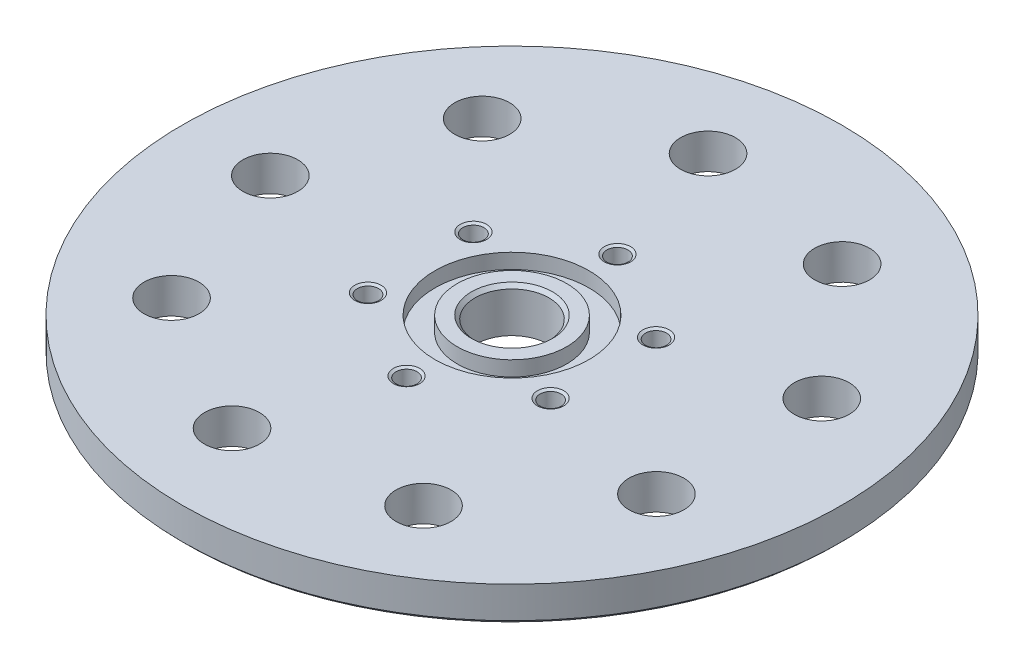
ISO-10303-21;
HEADER;
FILE_DESCRIPTION(('STEP AP214'),'2;1');
FILE_NAME('part.step','',(''),(''),'','','');
FILE_SCHEMA(('AUTOMOTIVE_DESIGN { 1 0 10303 214 1 1 1 1 }'));
ENDSEC;
DATA;
#1=APPLICATION_CONTEXT('core data for automotive mechanical design processes');
#2=APPLICATION_PROTOCOL_DEFINITION('international standard','automotive_design',2000,#1);
#3=PRODUCT_CONTEXT('',#1,'mechanical');
#4=PRODUCT('Part','Part','',(#3));
#5=PRODUCT_RELATED_PRODUCT_CATEGORY('part','',(#4));
#6=PRODUCT_DEFINITION_FORMATION('','',#4);
#7=PRODUCT_DEFINITION_CONTEXT('part definition',#1,'design');
#8=PRODUCT_DEFINITION('design','',#6,#7);
#9=PRODUCT_DEFINITION_SHAPE('','',#8);
#10=(LENGTH_UNIT() NAMED_UNIT(*) SI_UNIT(.MILLI.,.METRE.));
#11=(NAMED_UNIT(*) PLANE_ANGLE_UNIT() SI_UNIT($,.RADIAN.));
#12=(NAMED_UNIT(*) SI_UNIT($,.STERADIAN.) SOLID_ANGLE_UNIT());
#13=UNCERTAINTY_MEASURE_WITH_UNIT(LENGTH_MEASURE(1.E-05),#10,'distance_accuracy_value','');
#14=(GEOMETRIC_REPRESENTATION_CONTEXT(3) GLOBAL_UNCERTAINTY_ASSIGNED_CONTEXT((#13)) GLOBAL_UNIT_ASSIGNED_CONTEXT((#10,
#11,#12)) REPRESENTATION_CONTEXT('',''));
#15=CARTESIAN_POINT('',(0.,0.,0.));
#16=DIRECTION('',(0.,0.,1.));
#17=DIRECTION('',(1.,0.,0.));
#18=AXIS2_PLACEMENT_3D('',#15,#16,#17);
#19=CARTESIAN_POINT('',(0.,5.08,0.));
#20=DIRECTION('',(0.,-1.,0.));
#21=DIRECTION('',(0.,0.,-1.));
#22=AXIS2_PLACEMENT_3D('',#19,#20,#21);
#23=PLANE('',#22);
#24=CARTESIAN_POINT('',(13.1982271536748,5.08,-7.62000000000016));
#25=DIRECTION('',(0.,1.,0.));
#26=DIRECTION('',(0.,0.,1.));
#27=AXIS2_PLACEMENT_3D('',#24,#25,#26);
#28=CIRCLE('',#27,1.905);
#29=CARTESIAN_POINT('',(13.1982271536748,5.08,-5.71500000000016));
#30=VERTEX_POINT('',#29);
#31=EDGE_CURVE('E282',#30,#30,#28,.T.);
#32=ORIENTED_EDGE('',*,*,#31,.F.);
#33=EDGE_LOOP('',(#32));
#34=FACE_BOUND('',#33,.T.);
#35=CARTESIAN_POINT('',(-13.1982271536749,5.08,-7.61999999999996));
#36=DIRECTION('',(0.,1.,0.));
#37=DIRECTION('',(0.,0.,1.));
#38=AXIS2_PLACEMENT_3D('',#35,#36,#37);
#39=CIRCLE('',#38,1.905);
#40=CARTESIAN_POINT('',(-13.1982271536749,5.08,-5.71499999999996));
#41=VERTEX_POINT('',#40);
#42=EDGE_CURVE('E309',#41,#41,#39,.T.);
#43=ORIENTED_EDGE('',*,*,#42,.F.);
#44=EDGE_LOOP('',(#43));
#45=FACE_BOUND('',#44,.T.);
#46=CARTESIAN_POINT('',(0.,5.08,-15.24));
#47=DIRECTION('',(0.,1.,0.));
#48=DIRECTION('',(0.,0.,1.));
#49=AXIS2_PLACEMENT_3D('',#46,#47,#48);
#50=CIRCLE('',#49,1.905);
#51=CARTESIAN_POINT('',(0.,5.08,-13.335));
#52=VERTEX_POINT('',#51);
#53=EDGE_CURVE('E322',#52,#52,#50,.T.);
#54=ORIENTED_EDGE('',*,*,#53,.F.);
#55=EDGE_LOOP('',(#54));
#56=FACE_BOUND('',#55,.T.);
#57=CARTESIAN_POINT('',(0.,5.08,0.));
#58=DIRECTION('',(0.,1.,0.));
#59=DIRECTION('',(0.,0.,1.));
#60=AXIS2_PLACEMENT_3D('',#57,#58,#59);
#61=CIRCLE('',#60,11.1379);
#62=CARTESIAN_POINT('',(0.,5.08,11.1379));
#63=VERTEX_POINT('',#62);
#64=EDGE_CURVE('E398',#63,#63,#61,.T.);
#65=ORIENTED_EDGE('',*,*,#64,.F.);
#66=EDGE_LOOP('',(#65));
#67=FACE_BOUND('',#66,.T.);
#68=CARTESIAN_POINT('',(17.4625,5.08,30.2459372271715));
#69=DIRECTION('',(0.,1.,0.));
#70=DIRECTION('',(0.,0.,1.));
#71=AXIS2_PLACEMENT_3D('',#68,#69,#70);
#72=CIRCLE('',#71,3.96875);
#73=CARTESIAN_POINT('',(17.4625,5.08,34.2146872271715));
#74=VERTEX_POINT('',#73);
#75=EDGE_CURVE('E389',#74,#74,#72,.T.);
#76=ORIENTED_EDGE('',*,*,#75,.F.);
#77=EDGE_LOOP('',(#76));
#78=FACE_BOUND('',#77,.T.);
#79=CARTESIAN_POINT('',(32.8187647809479,5.08,11.9450535056489));
#80=DIRECTION('',(0.,1.,0.));
#81=DIRECTION('',(0.64278760968654,0.,0.766044443118976));
#82=AXIS2_PLACEMENT_3D('',#79,#80,#81);
#83=CIRCLE('',#82,3.96875);
#84=CARTESIAN_POINT('',(35.3698281068913,5.08,14.9852923892773));
#85=VERTEX_POINT('',#84);
#86=EDGE_CURVE('E383',#85,#85,#83,.T.);
#87=ORIENTED_EDGE('',*,*,#86,.F.);
#88=EDGE_LOOP('',(#87));
#89=FACE_BOUND('',#88,.T.);
#90=CARTESIAN_POINT('',(32.8187647809478,5.08,-11.9450535056491));
#91=DIRECTION('',(0.,1.,0.));
#92=DIRECTION('',(0.984807753012208,0.,0.173648177666927));
#93=AXIS2_PLACEMENT_3D('',#90,#91,#92);
#94=CIRCLE('',#93,3.96875);
#95=CARTESIAN_POINT('',(36.727220550715,5.08,-11.2558873005335));
#96=VERTEX_POINT('',#95);
#97=EDGE_CURVE('E377',#96,#96,#94,.T.);
#98=ORIENTED_EDGE('',*,*,#97,.F.);
#99=EDGE_LOOP('',(#98));
#100=FACE_BOUND('',#99,.T.);
#101=CARTESIAN_POINT('',(17.4624999999999,5.08,-30.2459372271716));
#102=DIRECTION('',(0.,1.,0.));
#103=DIRECTION('',(0.866025403784437,0.,-0.500000000000005));
#104=AXIS2_PLACEMENT_3D('',#101,#102,#103);
#105=CIRCLE('',#104,3.96875);
#106=CARTESIAN_POINT('',(20.8995383212694,5.08,-32.2303122271716));
#107=VERTEX_POINT('',#106);
#108=EDGE_CURVE('E371',#107,#107,#105,.T.);
#109=ORIENTED_EDGE('',*,*,#108,.F.);
#110=EDGE_LOOP('',(#109));
#111=FACE_BOUND('',#110,.T.);
#112=CARTESIAN_POINT('',(-6.06466260501772,5.08,-34.3944107739513));
#113=DIRECTION('',(0.,1.,0.));
#114=DIRECTION('',(0.342020143325664,0.,-0.939692620785911));
#115=AXIS2_PLACEMENT_3D('',#112,#113,#114);
#116=CIRCLE('',#115,3.96875);
#117=CARTESIAN_POINT('',(-4.707270161194,5.08,-38.1238158626954));
#118=VERTEX_POINT('',#117);
#119=EDGE_CURVE('E365',#118,#118,#116,.T.);
#120=ORIENTED_EDGE('',*,*,#119,.F.);
#121=EDGE_LOOP('',(#120));
#122=FACE_BOUND('',#121,.T.);
#123=CARTESIAN_POINT('',(-26.7541021759305,5.08,-22.4493572683022));
#124=DIRECTION('',(0.,1.,0.));
#125=DIRECTION('',(-0.342020143325675,0.,-0.939692620785905));
#126=AXIS2_PLACEMENT_3D('',#123,#124,#125);
#127=CIRCLE('',#126,3.96875);
#128=CARTESIAN_POINT('',(-28.1114946197542,5.08,-26.1787623570462));
#129=VERTEX_POINT('',#128);
#130=EDGE_CURVE('E359',#129,#129,#127,.T.);
#131=ORIENTED_EDGE('',*,*,#130,.F.);
#132=EDGE_LOOP('',(#131));
#133=FACE_BOUND('',#132,.T.);
#134=CARTESIAN_POINT('',(-34.925,5.08,3.46676506945975E-13));
#135=DIRECTION('',(0.,1.,0.));
#136=DIRECTION('',(-0.866025403784443,0.,-0.499999999999991));
#137=AXIS2_PLACEMENT_3D('',#134,#135,#136);
#138=CIRCLE('',#137,3.96875);
#139=CARTESIAN_POINT('',(-38.3620383212695,5.08,-1.98437499999962));
#140=VERTEX_POINT('',#139);
#141=EDGE_CURVE('E353',#140,#140,#138,.T.);
#142=ORIENTED_EDGE('',*,*,#141,.F.);
#143=EDGE_LOOP('',(#142));
#144=FACE_BOUND('',#143,.T.);
#145=CARTESIAN_POINT('',(-26.7541021759301,5.08,22.4493572683027));
#146=DIRECTION('',(0.,1.,0.));
#147=DIRECTION('',(-0.984807753012206,0.,0.173648177666941));
#148=AXIS2_PLACEMENT_3D('',#145,#146,#147);
#149=CIRCLE('',#148,3.96875);
#150=CARTESIAN_POINT('',(-30.6625579456973,5.08,23.1385234734183));
#151=VERTEX_POINT('',#150);
#152=EDGE_CURVE('E347',#151,#151,#149,.T.);
#153=ORIENTED_EDGE('',*,*,#152,.F.);
#154=EDGE_LOOP('',(#153));
#155=FACE_BOUND('',#154,.T.);
#156=CARTESIAN_POINT('',(-6.06466260501714,5.08,34.3944107739514));
#157=DIRECTION('',(0.,1.,0.));
#158=DIRECTION('',(-0.642787609686531,0.,0.766044443118987));
#159=AXIS2_PLACEMENT_3D('',#156,#157,#158);
#160=CIRCLE('',#159,3.96875);
#161=CARTESIAN_POINT('',(-8.61572593096056,5.08,37.4346496575799));
#162=VERTEX_POINT('',#161);
#163=EDGE_CURVE('E341',#162,#162,#160,.T.);
#164=ORIENTED_EDGE('',*,*,#163,.F.);
#165=EDGE_LOOP('',(#164));
#166=FACE_BOUND('',#165,.T.);
#167=CARTESIAN_POINT('',(0.,5.08,0.));
#168=DIRECTION('',(0.,-1.,0.));
#169=DIRECTION('',(0.,0.,-1.));
#170=AXIS2_PLACEMENT_3D('',#167,#168,#169);
#171=CIRCLE('',#170,47.625);
#172=CARTESIAN_POINT('',(0.,5.08,-47.625));
#173=VERTEX_POINT('',#172);
#174=EDGE_CURVE('E333',#173,#173,#171,.T.);
#175=ORIENTED_EDGE('',*,*,#174,.F.);
#176=EDGE_LOOP('',(#175));
#177=FACE_BOUND('',#176,.T.);
#178=CARTESIAN_POINT('',(-13.1982271536748,5.08,7.62000000000007));
#179=DIRECTION('',(0.,1.,0.));
#180=DIRECTION('',(0.,0.,1.));
#181=AXIS2_PLACEMENT_3D('',#178,#179,#180);
#182=CIRCLE('',#181,1.905);
#183=CARTESIAN_POINT('',(-13.1982271536748,5.08,9.52500000000007));
#184=VERTEX_POINT('',#183);
#185=EDGE_CURVE('E300',#184,#184,#182,.T.);
#186=ORIENTED_EDGE('',*,*,#185,.F.);
#187=EDGE_LOOP('',(#186));
#188=FACE_BOUND('',#187,.T.);
#189=CARTESIAN_POINT('',(0.,5.08,15.24));
#190=DIRECTION('',(0.,1.,0.));
#191=DIRECTION('',(0.,0.,1.));
#192=AXIS2_PLACEMENT_3D('',#189,#190,#191);
#193=CIRCLE('',#192,1.905);
#194=CARTESIAN_POINT('',(0.,5.08,17.145));
#195=VERTEX_POINT('',#194);
#196=EDGE_CURVE('E291',#195,#195,#193,.T.);
#197=ORIENTED_EDGE('',*,*,#196,.F.);
#198=EDGE_LOOP('',(#197));
#199=FACE_BOUND('',#198,.T.);
#200=CARTESIAN_POINT('',(13.1982271536749,5.08,7.61999999999987));
#201=DIRECTION('',(0.,1.,0.));
#202=DIRECTION('',(0.,0.,1.));
#203=AXIS2_PLACEMENT_3D('',#200,#201,#202);
#204=CIRCLE('',#203,1.905);
#205=CARTESIAN_POINT('',(13.1982271536749,5.08,9.52499999999987));
#206=VERTEX_POINT('',#205);
#207=EDGE_CURVE('E275',#206,#206,#204,.T.);
#208=ORIENTED_EDGE('',*,*,#207,.F.);
#209=EDGE_LOOP('',(#208));
#210=FACE_BOUND('',#209,.T.);
#211=ADVANCED_FACE('F238',(#34,#45,#56,#67,#78,#89,#100,#111,#122,#133,#144,#155,#166,#177,#188,
#199,#210),#23,.F.);
#212=CARTESIAN_POINT('',(0.,-1.27,0.));
#213=DIRECTION('',(0.,-1.,0.));
#214=DIRECTION('',(0.,0.,-1.));
#215=AXIS2_PLACEMENT_3D('',#212,#213,#214);
#216=PLANE('',#215);
#217=CARTESIAN_POINT('',(0.,-1.27,0.));
#218=DIRECTION('',(0.,-1.,0.));
#219=DIRECTION('',(0.,0.,-1.));
#220=AXIS2_PLACEMENT_3D('',#217,#218,#219);
#221=CIRCLE('',#220,5.3467);
#222=CARTESIAN_POINT('',(0.,-1.27,-5.3467));
#223=VERTEX_POINT('',#222);
#224=EDGE_CURVE('E334',#223,#223,#221,.T.);
#225=ORIENTED_EDGE('',*,*,#224,.F.);
#226=EDGE_LOOP('',(#225));
#227=FACE_BOUND('',#226,.T.);
#228=CARTESIAN_POINT('',(0.,-1.27,0.));
#229=DIRECTION('',(0.,-1.,0.));
#230=DIRECTION('',(0.,0.,-1.));
#231=AXIS2_PLACEMENT_3D('',#228,#229,#230);
#232=CIRCLE('',#231,10.9855);
#233=CARTESIAN_POINT('',(0.,-1.27,-10.9855));
#234=VERTEX_POINT('',#233);
#235=EDGE_CURVE('E318',#234,#234,#232,.T.);
#236=ORIENTED_EDGE('',*,*,#235,.T.);
#237=EDGE_LOOP('',(#236));
#238=FACE_BOUND('',#237,.T.);
#239=ADVANCED_FACE('F439',(#227,#238),#216,.T.);
#240=CARTESIAN_POINT('',(0.,0.,0.));
#241=DIRECTION('',(0.,-1.,0.));
#242=DIRECTION('',(0.,0.,-1.));
#243=AXIS2_PLACEMENT_3D('',#240,#241,#242);
#244=PLANE('',#243);
#245=CARTESIAN_POINT('',(0.,0.,0.));
#246=DIRECTION('',(0.,-1.,0.));
#247=DIRECTION('',(0.,0.,-1.));
#248=AXIS2_PLACEMENT_3D('',#245,#246,#247);
#249=CIRCLE('',#248,47.117);
#250=CARTESIAN_POINT('',(0.,0.,-47.117));
#251=VERTEX_POINT('',#250);
#252=EDGE_CURVE('E246',#251,#251,#249,.T.);
#253=ORIENTED_EDGE('',*,*,#252,.T.);
#254=EDGE_LOOP('',(#253));
#255=FACE_BOUND('',#254,.T.);
#256=CARTESIAN_POINT('',(0.,0.,0.));
#257=DIRECTION('',(0.,-1.,0.));
#258=DIRECTION('',(0.,0.,-1.));
#259=AXIS2_PLACEMENT_3D('',#256,#257,#258);
#260=CIRCLE('',#259,19.05);
#261=CARTESIAN_POINT('',(0.,0.,-19.05));
#262=VERTEX_POINT('',#261);
#263=EDGE_CURVE('E337',#262,#262,#260,.T.);
#264=ORIENTED_EDGE('',*,*,#263,.F.);
#265=EDGE_LOOP('',(#264));
#266=FACE_BOUND('',#265,.T.);
#267=CARTESIAN_POINT('',(-6.06466260501715,0.,34.3944107739514));
#268=DIRECTION('',(0.,-1.,0.));
#269=DIRECTION('',(0.,0.,-1.));
#270=AXIS2_PLACEMENT_3D('',#267,#268,#269);
#271=CIRCLE('',#270,3.96875);
#272=CARTESIAN_POINT('',(-6.06466260501714,0.,30.4256607739514));
#273=VERTEX_POINT('',#272);
#274=EDGE_CURVE('E340',#273,#273,#271,.F.);
#275=ORIENTED_EDGE('',*,*,#274,.T.);
#276=EDGE_LOOP('',(#275));
#277=FACE_BOUND('',#276,.T.);
#278=CARTESIAN_POINT('',(-26.7541021759301,0.,22.4493572683027));
#279=DIRECTION('',(0.,-1.,0.));
#280=DIRECTION('',(0.,0.,-1.));
#281=AXIS2_PLACEMENT_3D('',#278,#279,#280);
#282=CIRCLE('',#281,3.96875);
#283=CARTESIAN_POINT('',(-26.7541021759301,0.,18.4806072683027));
#284=VERTEX_POINT('',#283);
#285=EDGE_CURVE('E344',#284,#284,#282,.F.);
#286=ORIENTED_EDGE('',*,*,#285,.T.);
#287=EDGE_LOOP('',(#286));
#288=FACE_BOUND('',#287,.T.);
#289=CARTESIAN_POINT('',(-34.925,0.,3.46676506945975E-13));
#290=DIRECTION('',(0.,-1.,0.));
#291=DIRECTION('',(0.,0.,-1.));
#292=AXIS2_PLACEMENT_3D('',#289,#290,#291);
#293=CIRCLE('',#292,3.96875);
#294=CARTESIAN_POINT('',(-34.925,0.,-3.96874999999965));
#295=VERTEX_POINT('',#294);
#296=EDGE_CURVE('E350',#295,#295,#293,.F.);
#297=ORIENTED_EDGE('',*,*,#296,.T.);
#298=EDGE_LOOP('',(#297));
#299=FACE_BOUND('',#298,.T.);
#300=CARTESIAN_POINT('',(-26.7541021759305,0.,-22.4493572683022));
#301=DIRECTION('',(0.,-1.,0.));
#302=DIRECTION('',(0.,0.,-1.));
#303=AXIS2_PLACEMENT_3D('',#300,#301,#302);
#304=CIRCLE('',#303,3.96875);
#305=CARTESIAN_POINT('',(-26.7541021759305,0.,-26.4181072683022));
#306=VERTEX_POINT('',#305);
#307=EDGE_CURVE('E356',#306,#306,#304,.F.);
#308=ORIENTED_EDGE('',*,*,#307,.T.);
#309=EDGE_LOOP('',(#308));
#310=FACE_BOUND('',#309,.T.);
#311=CARTESIAN_POINT('',(-6.06466260501773,0.,-34.3944107739513));
#312=DIRECTION('',(0.,-1.,0.));
#313=DIRECTION('',(0.,0.,-1.));
#314=AXIS2_PLACEMENT_3D('',#311,#312,#313);
#315=CIRCLE('',#314,3.96875);
#316=CARTESIAN_POINT('',(-6.06466260501773,0.,-38.3631607739513));
#317=VERTEX_POINT('',#316);
#318=EDGE_CURVE('E362',#317,#317,#315,.F.);
#319=ORIENTED_EDGE('',*,*,#318,.T.);
#320=EDGE_LOOP('',(#319));
#321=FACE_BOUND('',#320,.T.);
#322=CARTESIAN_POINT('',(17.4624999999999,0.,-30.2459372271716));
#323=DIRECTION('',(0.,-1.,0.));
#324=DIRECTION('',(0.,0.,-1.));
#325=AXIS2_PLACEMENT_3D('',#322,#323,#324);
#326=CIRCLE('',#325,3.96875);
#327=CARTESIAN_POINT('',(17.4624999999999,0.,-34.2146872271716));
#328=VERTEX_POINT('',#327);
#329=EDGE_CURVE('E368',#328,#328,#326,.F.);
#330=ORIENTED_EDGE('',*,*,#329,.T.);
#331=EDGE_LOOP('',(#330));
#332=FACE_BOUND('',#331,.T.);
#333=CARTESIAN_POINT('',(32.8187647809478,0.,-11.9450535056491));
#334=DIRECTION('',(0.,-1.,0.));
#335=DIRECTION('',(0.,0.,-1.));
#336=AXIS2_PLACEMENT_3D('',#333,#334,#335);
#337=CIRCLE('',#336,3.96875);
#338=CARTESIAN_POINT('',(32.8187647809478,0.,-15.9138035056491));
#339=VERTEX_POINT('',#338);
#340=EDGE_CURVE('E374',#339,#339,#337,.F.);
#341=ORIENTED_EDGE('',*,*,#340,.T.);
#342=EDGE_LOOP('',(#341));
#343=FACE_BOUND('',#342,.T.);
#344=CARTESIAN_POINT('',(32.8187647809479,0.,11.9450535056489));
#345=DIRECTION('',(0.,-1.,0.));
#346=DIRECTION('',(0.,0.,-1.));
#347=AXIS2_PLACEMENT_3D('',#344,#345,#346);
#348=CIRCLE('',#347,3.96875);
#349=CARTESIAN_POINT('',(32.8187647809479,0.,7.97630350564891));
#350=VERTEX_POINT('',#349);
#351=EDGE_CURVE('E380',#350,#350,#348,.F.);
#352=ORIENTED_EDGE('',*,*,#351,.T.);
#353=EDGE_LOOP('',(#352));
#354=FACE_BOUND('',#353,.T.);
#355=CARTESIAN_POINT('',(17.4625,0.,30.2459372271715));
#356=DIRECTION('',(0.,-1.,0.));
#357=DIRECTION('',(0.,0.,-1.));
#358=AXIS2_PLACEMENT_3D('',#355,#356,#357);
#359=CIRCLE('',#358,3.96875);
#360=CARTESIAN_POINT('',(17.4625,0.,26.2771872271715));
#361=VERTEX_POINT('',#360);
#362=EDGE_CURVE('E386',#361,#361,#359,.F.);
#363=ORIENTED_EDGE('',*,*,#362,.T.);
#364=EDGE_LOOP('',(#363));
#365=FACE_BOUND('',#364,.T.);
#366=ADVANCED_FACE('F422',(#255,#266,#277,#288,#299,#310,#321,#332,#343,#354,#365),#244,.T.);
#367=CARTESIAN_POINT('',(0.,5.08,0.));
#368=DIRECTION('',(0.,-1.,0.));
#369=DIRECTION('',(0.,0.,-1.));
#370=AXIS2_PLACEMENT_3D('',#367,#368,#369);
#371=CIRCLE('',#370,5.85470000000003);
#372=CARTESIAN_POINT('',(0.,5.08,-5.85470000000003));
#373=VERTEX_POINT('',#372);
#374=EDGE_CURVE('E411',#373,#373,#371,.T.);
#375=ORIENTED_EDGE('',*,*,#374,.T.);
#376=EDGE_LOOP('',(#375));
#377=FACE_BOUND('',#376,.T.);
#378=CARTESIAN_POINT('',(0.,5.08,0.));
#379=DIRECTION('',(0.,1.,0.));
#380=DIRECTION('',(0.,0.,1.));
#381=AXIS2_PLACEMENT_3D('',#378,#379,#380);
#382=CIRCLE('',#381,7.9121);
#383=CARTESIAN_POINT('',(0.,5.08,7.9121));
#384=VERTEX_POINT('',#383);
#385=EDGE_CURVE('E392',#384,#384,#382,.T.);
#386=ORIENTED_EDGE('',*,*,#385,.T.);
#387=EDGE_LOOP('',(#386));
#388=FACE_BOUND('',#387,.T.);
#389=ADVANCED_FACE('F442',(#377,#388),#23,.F.);
#390=CARTESIAN_POINT('',(0.,-0.00100000000000013,0.));
#391=DIRECTION('',(0.,1.,0.));
#392=DIRECTION('',(0.,0.,1.));
#393=AXIS2_PLACEMENT_3D('',#390,#391,#392);
#394=CYLINDRICAL_SURFACE('',#393,5.3467);
#395=CARTESIAN_POINT('',(0.,4.57199999999998,0.));
#396=DIRECTION('',(0.,-1.,0.));
#397=DIRECTION('',(0.,0.,-1.));
#398=AXIS2_PLACEMENT_3D('',#395,#396,#397);
#399=CIRCLE('',#398,5.3467);
#400=CARTESIAN_POINT('',(0.,4.57199999999998,-5.3467));
#401=VERTEX_POINT('',#400);
#402=EDGE_CURVE('E404',#401,#401,#399,.F.);
#403=ORIENTED_EDGE('',*,*,#402,.T.);
#404=EDGE_LOOP('',(#403));
#405=FACE_BOUND('',#404,.T.);
#406=ORIENTED_EDGE('',*,*,#224,.T.);
#407=EDGE_LOOP('',(#406));
#408=FACE_BOUND('',#407,.T.);
#409=ADVANCED_FACE('F453',(#405,#408),#394,.F.);
#410=CARTESIAN_POINT('',(0.,2.921,0.));
#411=DIRECTION('',(0.,1.,0.));
#412=DIRECTION('',(0.,0.,1.));
#413=AXIS2_PLACEMENT_3D('',#410,#411,#412);
#414=CYLINDRICAL_SURFACE('',#413,11.1379);
#415=CARTESIAN_POINT('',(0.,2.921,0.));
#416=DIRECTION('',(0.,1.,0.));
#417=DIRECTION('',(0.,0.,1.));
#418=AXIS2_PLACEMENT_3D('',#415,#416,#417);
#419=CIRCLE('',#418,11.1379);
#420=CARTESIAN_POINT('',(0.,2.921,11.1379));
#421=VERTEX_POINT('',#420);
#422=EDGE_CURVE('E401',#421,#421,#419,.T.);
#423=ORIENTED_EDGE('',*,*,#422,.F.);
#424=EDGE_LOOP('',(#423));
#425=FACE_BOUND('',#424,.T.);
#426=ORIENTED_EDGE('',*,*,#64,.T.);
#427=EDGE_LOOP('',(#426));
#428=FACE_BOUND('',#427,.T.);
#429=ADVANCED_FACE('F459',(#425,#428),#414,.F.);
#430=CARTESIAN_POINT('',(0.,2.921,0.));
#431=DIRECTION('',(0.,1.,0.));
#432=DIRECTION('',(0.,0.,1.));
#433=AXIS2_PLACEMENT_3D('',#430,#431,#432);
#434=PLANE('',#433);
#435=CARTESIAN_POINT('',(0.,2.921,0.));
#436=DIRECTION('',(0.,1.,0.));
#437=DIRECTION('',(0.,0.,1.));
#438=AXIS2_PLACEMENT_3D('',#435,#436,#437);
#439=CIRCLE('',#438,7.9121);
#440=CARTESIAN_POINT('',(0.,2.921,7.9121));
#441=VERTEX_POINT('',#440);
#442=EDGE_CURVE('E395',#441,#441,#439,.T.);
#443=ORIENTED_EDGE('',*,*,#442,.F.);
#444=EDGE_LOOP('',(#443));
#445=FACE_BOUND('',#444,.T.);
#446=ORIENTED_EDGE('',*,*,#422,.T.);
#447=EDGE_LOOP('',(#446));
#448=FACE_BOUND('',#447,.T.);
#449=ADVANCED_FACE('F468',(#445,#448),#434,.T.);
#450=CARTESIAN_POINT('',(0.,2.921,0.));
#451=DIRECTION('',(0.,1.,0.));
#452=DIRECTION('',(0.,0.,1.));
#453=AXIS2_PLACEMENT_3D('',#450,#451,#452);
#454=CYLINDRICAL_SURFACE('',#453,7.9121);
#455=ORIENTED_EDGE('',*,*,#442,.T.);
#456=EDGE_LOOP('',(#455));
#457=FACE_BOUND('',#456,.T.);
#458=ORIENTED_EDGE('',*,*,#385,.F.);
#459=EDGE_LOOP('',(#458));
#460=FACE_BOUND('',#459,.T.);
#461=ADVANCED_FACE('F465',(#457,#460),#454,.T.);
#462=CARTESIAN_POINT('',(17.4625,-0.000999999999999265,30.2459372271715));
#463=DIRECTION('',(0.,1.,0.));
#464=DIRECTION('',(0.,0.,1.));
#465=AXIS2_PLACEMENT_3D('',#462,#463,#464);
#466=CYLINDRICAL_SURFACE('',#465,3.96875);
#467=ORIENTED_EDGE('',*,*,#362,.F.);
#468=EDGE_LOOP('',(#467));
#469=FACE_BOUND('',#468,.T.);
#470=ORIENTED_EDGE('',*,*,#75,.T.);
#471=EDGE_LOOP('',(#470));
#472=FACE_BOUND('',#471,.T.);
#473=ADVANCED_FACE('F467',(#469,#472),#466,.F.);
#474=CARTESIAN_POINT('',(32.8187647809479,-0.00100000000000057,11.9450535056489));
#475=DIRECTION('',(0.,1.,0.));
#476=DIRECTION('',(0.,0.,1.));
#477=AXIS2_PLACEMENT_3D('',#474,#475,#476);
#478=CYLINDRICAL_SURFACE('',#477,3.96875);
#479=ORIENTED_EDGE('',*,*,#351,.F.);
#480=EDGE_LOOP('',(#479));
#481=FACE_BOUND('',#480,.T.);
#482=ORIENTED_EDGE('',*,*,#86,.T.);
#483=EDGE_LOOP('',(#482));
#484=FACE_BOUND('',#483,.T.);
#485=ADVANCED_FACE('F475',(#481,#484),#478,.F.);
#486=CARTESIAN_POINT('',(32.8187647809478,-0.000999999999999265,-11.9450535056491));
#487=DIRECTION('',(0.,1.,0.));
#488=DIRECTION('',(0.,0.,1.));
#489=AXIS2_PLACEMENT_3D('',#486,#487,#488);
#490=CYLINDRICAL_SURFACE('',#489,3.96875);
#491=ORIENTED_EDGE('',*,*,#340,.F.);
#492=EDGE_LOOP('',(#491));
#493=FACE_BOUND('',#492,.T.);
#494=ORIENTED_EDGE('',*,*,#97,.T.);
#495=EDGE_LOOP('',(#494));
#496=FACE_BOUND('',#495,.T.);
#497=ADVANCED_FACE('F614',(#493,#496),#490,.F.);
#498=CARTESIAN_POINT('',(17.4624999999999,-0.00100000000000273,-30.2459372271716));
#499=DIRECTION('',(0.,1.,0.));
#500=DIRECTION('',(0.,0.,1.));
#501=AXIS2_PLACEMENT_3D('',#498,#499,#500);
#502=CYLINDRICAL_SURFACE('',#501,3.96875);
#503=ORIENTED_EDGE('',*,*,#329,.F.);
#504=EDGE_LOOP('',(#503));
#505=FACE_BOUND('',#504,.T.);
#506=ORIENTED_EDGE('',*,*,#108,.T.);
#507=EDGE_LOOP('',(#506));
#508=FACE_BOUND('',#507,.T.);
#509=ADVANCED_FACE('F610',(#505,#508),#502,.F.);
#510=CARTESIAN_POINT('',(-6.06466260501773,-0.000999999999999265,-34.3944107739513));
#511=DIRECTION('',(0.,1.,0.));
#512=DIRECTION('',(0.,0.,1.));
#513=AXIS2_PLACEMENT_3D('',#510,#511,#512);
#514=CYLINDRICAL_SURFACE('',#513,3.96875);
#515=ORIENTED_EDGE('',*,*,#318,.F.);
#516=EDGE_LOOP('',(#515));
#517=FACE_BOUND('',#516,.T.);
#518=ORIENTED_EDGE('',*,*,#119,.T.);
#519=EDGE_LOOP('',(#518));
#520=FACE_BOUND('',#519,.T.);
#521=ADVANCED_FACE('F606',(#517,#520),#514,.F.);
#522=CARTESIAN_POINT('',(-26.7541021759305,-0.00100000000000187,-22.4493572683022));
#523=DIRECTION('',(0.,1.,0.));
#524=DIRECTION('',(0.,0.,1.));
#525=AXIS2_PLACEMENT_3D('',#522,#523,#524);
#526=CYLINDRICAL_SURFACE('',#525,3.96875);
#527=ORIENTED_EDGE('',*,*,#307,.F.);
#528=EDGE_LOOP('',(#527));
#529=FACE_BOUND('',#528,.T.);
#530=ORIENTED_EDGE('',*,*,#130,.T.);
#531=EDGE_LOOP('',(#530));
#532=FACE_BOUND('',#531,.T.);
#533=ADVANCED_FACE('F602',(#529,#532),#526,.F.);
#534=CARTESIAN_POINT('',(-34.925,-0.00100000000000273,3.49278592159941E-13));
#535=DIRECTION('',(0.,1.,0.));
#536=DIRECTION('',(0.,0.,1.));
#537=AXIS2_PLACEMENT_3D('',#534,#535,#536);
#538=CYLINDRICAL_SURFACE('',#537,3.96875);
#539=ORIENTED_EDGE('',*,*,#296,.F.);
#540=EDGE_LOOP('',(#539));
#541=FACE_BOUND('',#540,.T.);
#542=ORIENTED_EDGE('',*,*,#141,.T.);
#543=EDGE_LOOP('',(#542));
#544=FACE_BOUND('',#543,.T.);
#545=ADVANCED_FACE('F598',(#541,#544),#538,.F.);
#546=CARTESIAN_POINT('',(-26.7541021759301,-0.0010000000000062,22.4493572683027));
#547=DIRECTION('',(0.,1.,0.));
#548=DIRECTION('',(0.,0.,1.));
#549=AXIS2_PLACEMENT_3D('',#546,#547,#548);
#550=CYLINDRICAL_SURFACE('',#549,3.96875);
#551=ORIENTED_EDGE('',*,*,#285,.F.);
#552=EDGE_LOOP('',(#551));
#553=FACE_BOUND('',#552,.T.);
#554=ORIENTED_EDGE('',*,*,#152,.T.);
#555=EDGE_LOOP('',(#554));
#556=FACE_BOUND('',#555,.T.);
#557=ADVANCED_FACE('F594',(#553,#556),#550,.F.);
#558=CARTESIAN_POINT('',(-6.06466260501714,-0.000999999999999265,34.3944107739514));
#559=DIRECTION('',(0.,1.,0.));
#560=DIRECTION('',(0.,0.,1.));
#561=AXIS2_PLACEMENT_3D('',#558,#559,#560);
#562=CYLINDRICAL_SURFACE('',#561,3.96875);
#563=ORIENTED_EDGE('',*,*,#274,.F.);
#564=EDGE_LOOP('',(#563));
#565=FACE_BOUND('',#564,.T.);
#566=ORIENTED_EDGE('',*,*,#163,.T.);
#567=EDGE_LOOP('',(#566));
#568=FACE_BOUND('',#567,.T.);
#569=ADVANCED_FACE('F590',(#565,#568),#562,.F.);
#570=CARTESIAN_POINT('',(0.,-1.27,0.));
#571=DIRECTION('',(0.,1.,0.));
#572=DIRECTION('',(0.,0.,1.));
#573=AXIS2_PLACEMENT_3D('',#570,#571,#572);
#574=CYLINDRICAL_SURFACE('',#573,19.05);
#575=CARTESIAN_POINT('',(0.,-1.52400000000001,0.));
#576=DIRECTION('',(0.,-1.,0.));
#577=DIRECTION('',(0.,0.,-1.));
#578=AXIS2_PLACEMENT_3D('',#575,#576,#577);
#579=CIRCLE('',#578,19.05);
#580=CARTESIAN_POINT('',(0.,-1.52400000000001,-19.05));
#581=VERTEX_POINT('',#580);
#582=EDGE_CURVE('E417',#581,#581,#579,.F.);
#583=ORIENTED_EDGE('',*,*,#582,.T.);
#584=EDGE_LOOP('',(#583));
#585=FACE_BOUND('',#584,.T.);
#586=ORIENTED_EDGE('',*,*,#263,.T.);
#587=EDGE_LOOP('',(#586));
#588=FACE_BOUND('',#587,.T.);
#589=ADVANCED_FACE('F585',(#585,#588),#574,.T.);
#590=CARTESIAN_POINT('',(0.,-1.27,0.));
#591=DIRECTION('',(0.,1.,0.));
#592=DIRECTION('',(0.,0.,1.));
#593=AXIS2_PLACEMENT_3D('',#590,#591,#592);
#594=CYLINDRICAL_SURFACE('',#593,47.625);
#595=CARTESIAN_POINT('',(0.,0.50799999999998,0.));
#596=DIRECTION('',(0.,-1.,0.));
#597=DIRECTION('',(0.,0.,-1.));
#598=AXIS2_PLACEMENT_3D('',#595,#596,#597);
#599=CIRCLE('',#598,47.625);
#600=CARTESIAN_POINT('',(0.,0.50799999999998,-47.625));
#601=VERTEX_POINT('',#600);
#602=EDGE_CURVE('E12',#601,#601,#599,.F.);
#603=ORIENTED_EDGE('',*,*,#602,.T.);
#604=EDGE_LOOP('',(#603));
#605=FACE_BOUND('',#604,.T.);
#606=ORIENTED_EDGE('',*,*,#174,.T.);
#607=EDGE_LOOP('',(#606));
#608=FACE_BOUND('',#607,.T.);
#609=ADVANCED_FACE('F583',(#605,#608),#594,.T.);
#610=CARTESIAN_POINT('',(0.,-0.253999999999999,-15.24));
#611=DIRECTION('',(0.,1.,0.));
#612=DIRECTION('',(0.,0.,1.));
#613=AXIS2_PLACEMENT_3D('',#610,#611,#612);
#614=CONICAL_SURFACE('',#613,1.524,1.02974425867665);
#615=CARTESIAN_POINT('',(0.,-1.169711583398,-15.24));
#616=VERTEX_POINT('',#615);
#617=VERTEX_LOOP('',#616);
#618=FACE_BOUND('',#617,.T.);
#619=CARTESIAN_POINT('',(0.,-0.253999999999999,-15.24));
#620=DIRECTION('',(0.,1.,0.));
#621=DIRECTION('',(0.,0.,1.));
#622=AXIS2_PLACEMENT_3D('',#619,#620,#621);
#623=CIRCLE('',#622,1.524);
#624=CARTESIAN_POINT('',(0.,-0.253999999999999,-13.716));
#625=VERTEX_POINT('',#624);
#626=EDGE_CURVE('E330',#625,#625,#623,.T.);
#627=ORIENTED_EDGE('',*,*,#626,.T.);
#628=EDGE_LOOP('',(#627));
#629=FACE_BOUND('',#628,.T.);
#630=ADVANCED_FACE('F579',(#618,#629),#614,.F.);
#631=CARTESIAN_POINT('',(0.,5.08,-15.24));
#632=DIRECTION('',(0.,1.,0.));
#633=DIRECTION('',(0.,0.,1.));
#634=AXIS2_PLACEMENT_3D('',#631,#632,#633);
#635=CYLINDRICAL_SURFACE('',#634,1.524);
#636=ORIENTED_EDGE('',*,*,#626,.F.);
#637=EDGE_LOOP('',(#636));
#638=FACE_BOUND('',#637,.T.);
#639=CARTESIAN_POINT('',(0.,4.86002954743875,-15.24));
#640=DIRECTION('',(0.,1.,0.));
#641=DIRECTION('',(0.,0.,1.));
#642=AXIS2_PLACEMENT_3D('',#639,#640,#641);
#643=CIRCLE('',#642,1.524);
#644=CARTESIAN_POINT('',(0.,4.86002954743875,-13.716));
#645=VERTEX_POINT('',#644);
#646=EDGE_CURVE('E327',#645,#645,#643,.T.);
#647=ORIENTED_EDGE('',*,*,#646,.T.);
#648=EDGE_LOOP('',(#647));
#649=FACE_BOUND('',#648,.T.);
#650=ADVANCED_FACE('F575',(#638,#649),#635,.F.);
#651=CARTESIAN_POINT('',(0.,5.08,-15.24));
#652=DIRECTION('',(0.,1.,0.));
#653=DIRECTION('',(0.,0.,1.));
#654=AXIS2_PLACEMENT_3D('',#651,#652,#653);
#655=CONICAL_SURFACE('',#654,1.905,1.0471975511966);
#656=ORIENTED_EDGE('',*,*,#646,.F.);
#657=EDGE_LOOP('',(#656));
#658=FACE_BOUND('',#657,.T.);
#659=ORIENTED_EDGE('',*,*,#53,.T.);
#660=EDGE_LOOP('',(#659));
#661=FACE_BOUND('',#660,.T.);
#662=ADVANCED_FACE('F571',(#658,#661),#655,.F.);
#663=CARTESIAN_POINT('',(0.,-2.032,0.));
#664=DIRECTION('',(0.,-1.,0.));
#665=DIRECTION('',(0.,0.,-1.));
#666=AXIS2_PLACEMENT_3D('',#663,#664,#665);
#667=PLANE('',#666);
#668=CARTESIAN_POINT('',(0.,-2.032,0.));
#669=DIRECTION('',(0.,-1.,0.));
#670=DIRECTION('',(0.,0.,-1.));
#671=AXIS2_PLACEMENT_3D('',#668,#669,#670);
#672=CIRCLE('',#671,18.542);
#673=CARTESIAN_POINT('',(0.,-2.032,-18.542));
#674=VERTEX_POINT('',#673);
#675=EDGE_CURVE('E414',#674,#674,#672,.T.);
#676=ORIENTED_EDGE('',*,*,#675,.T.);
#677=EDGE_LOOP('',(#676));
#678=FACE_BOUND('',#677,.T.);
#679=CARTESIAN_POINT('',(0.,-2.032,0.));
#680=DIRECTION('',(0.,-1.,0.));
#681=DIRECTION('',(0.,0.,-1.));
#682=AXIS2_PLACEMENT_3D('',#679,#680,#681);
#683=CIRCLE('',#682,10.9855);
#684=CARTESIAN_POINT('',(0.,-2.032,-10.9855));
#685=VERTEX_POINT('',#684);
#686=EDGE_CURVE('E319',#685,#685,#683,.T.);
#687=ORIENTED_EDGE('',*,*,#686,.F.);
#688=EDGE_LOOP('',(#687));
#689=FACE_BOUND('',#688,.T.);
#690=ADVANCED_FACE('F567',(#678,#689),#667,.T.);
#691=CARTESIAN_POINT('',(0.,-2.032,0.));
#692=DIRECTION('',(0.,1.,0.));
#693=DIRECTION('',(0.,0.,1.));
#694=AXIS2_PLACEMENT_3D('',#691,#692,#693);
#695=CYLINDRICAL_SURFACE('',#694,10.9855);
#696=ORIENTED_EDGE('',*,*,#686,.T.);
#697=EDGE_LOOP('',(#696));
#698=FACE_BOUND('',#697,.T.);
#699=ORIENTED_EDGE('',*,*,#235,.F.);
#700=EDGE_LOOP('',(#699));
#701=FACE_BOUND('',#700,.T.);
#702=ADVANCED_FACE('F564',(#698,#701),#695,.F.);
#703=CARTESIAN_POINT('',(0.,4.57199999999998,0.));
#704=DIRECTION('',(0.,1.,0.));
#705=DIRECTION('',(0.,0.,1.));
#706=AXIS2_PLACEMENT_3D('',#703,#704,#705);
#707=CONICAL_SURFACE('',#706,5.3467,0.785398163397457);
#708=ORIENTED_EDGE('',*,*,#374,.F.);
#709=EDGE_LOOP('',(#708));
#710=FACE_BOUND('',#709,.T.);
#711=ORIENTED_EDGE('',*,*,#402,.F.);
#712=EDGE_LOOP('',(#711));
#713=FACE_BOUND('',#712,.T.);
#714=ADVANCED_FACE('F435',(#710,#713),#707,.F.);
#715=CARTESIAN_POINT('',(0.,-2.032,0.));
#716=DIRECTION('',(0.,1.,0.));
#717=DIRECTION('',(0.,0.,1.));
#718=AXIS2_PLACEMENT_3D('',#715,#716,#717);
#719=CONICAL_SURFACE('',#718,18.542,0.785398163397452);
#720=ORIENTED_EDGE('',*,*,#582,.F.);
#721=EDGE_LOOP('',(#720));
#722=FACE_BOUND('',#721,.T.);
#723=ORIENTED_EDGE('',*,*,#675,.F.);
#724=EDGE_LOOP('',(#723));
#725=FACE_BOUND('',#724,.T.);
#726=ADVANCED_FACE('F427',(#722,#725),#719,.T.);
#727=CARTESIAN_POINT('',(0.,0.,0.));
#728=DIRECTION('',(0.,1.,0.));
#729=DIRECTION('',(0.,0.,1.));
#730=AXIS2_PLACEMENT_3D('',#727,#728,#729);
#731=CONICAL_SURFACE('',#730,47.117,0.785398163397442);
#732=ORIENTED_EDGE('',*,*,#602,.F.);
#733=EDGE_LOOP('',(#732));
#734=FACE_BOUND('',#733,.T.);
#735=ORIENTED_EDGE('',*,*,#252,.F.);
#736=EDGE_LOOP('',(#735));
#737=FACE_BOUND('',#736,.T.);
#738=ADVANCED_FACE('F240',(#734,#737),#731,.T.);
#739=CARTESIAN_POINT('',(-13.1982271536749,-0.253999999999999,-7.61999999999996));
#740=DIRECTION('',(0.,1.,0.));
#741=DIRECTION('',(0.,0.,1.));
#742=AXIS2_PLACEMENT_3D('',#739,#740,#741);
#743=CONICAL_SURFACE('',#742,1.524,1.02974425867665);
#744=CARTESIAN_POINT('',(-13.1982271536749,-1.169711583398,-7.61999999999996));
#745=VERTEX_POINT('',#744);
#746=VERTEX_LOOP('',#745);
#747=FACE_BOUND('',#746,.T.);
#748=CARTESIAN_POINT('',(-13.1982271536749,-0.253999999999999,-7.61999999999996));
#749=DIRECTION('',(0.,1.,0.));
#750=DIRECTION('',(0.,0.,1.));
#751=AXIS2_PLACEMENT_3D('',#748,#749,#750);
#752=CIRCLE('',#751,1.524);
#753=CARTESIAN_POINT('',(-13.1982271536749,-0.253999999999999,-6.09599999999996));
#754=VERTEX_POINT('',#753);
#755=EDGE_CURVE('E315',#754,#754,#752,.T.);
#756=ORIENTED_EDGE('',*,*,#755,.T.);
#757=EDGE_LOOP('',(#756));
#758=FACE_BOUND('',#757,.T.);
#759=ADVANCED_FACE('F426',(#747,#758),#743,.F.);
#760=CARTESIAN_POINT('',(-13.1982271536749,5.08,-7.61999999999996));
#761=DIRECTION('',(0.,1.,0.));
#762=DIRECTION('',(0.,0.,1.));
#763=AXIS2_PLACEMENT_3D('',#760,#761,#762);
#764=CYLINDRICAL_SURFACE('',#763,1.524);
#765=ORIENTED_EDGE('',*,*,#755,.F.);
#766=EDGE_LOOP('',(#765));
#767=FACE_BOUND('',#766,.T.);
#768=CARTESIAN_POINT('',(-13.1982271536749,4.86002954743875,-7.61999999999996));
#769=DIRECTION('',(0.,1.,0.));
#770=DIRECTION('',(0.,0.,1.));
#771=AXIS2_PLACEMENT_3D('',#768,#769,#770);
#772=CIRCLE('',#771,1.524);
#773=CARTESIAN_POINT('',(-13.1982271536749,4.86002954743875,-6.09599999999996));
#774=VERTEX_POINT('',#773);
#775=EDGE_CURVE('E312',#774,#774,#772,.T.);
#776=ORIENTED_EDGE('',*,*,#775,.T.);
#777=EDGE_LOOP('',(#776));
#778=FACE_BOUND('',#777,.T.);
#779=ADVANCED_FACE('F433',(#767,#778),#764,.F.);
#780=CARTESIAN_POINT('',(-13.1982271536749,5.08,-7.61999999999996));
#781=DIRECTION('',(0.,1.,0.));
#782=DIRECTION('',(0.,0.,1.));
#783=AXIS2_PLACEMENT_3D('',#780,#781,#782);
#784=CONICAL_SURFACE('',#783,1.905,1.0471975511966);
#785=ORIENTED_EDGE('',*,*,#775,.F.);
#786=EDGE_LOOP('',(#785));
#787=FACE_BOUND('',#786,.T.);
#788=ORIENTED_EDGE('',*,*,#42,.T.);
#789=EDGE_LOOP('',(#788));
#790=FACE_BOUND('',#789,.T.);
#791=ADVANCED_FACE('F556',(#787,#790),#784,.F.);
#792=CARTESIAN_POINT('',(-13.1982271536748,-0.254,7.62000000000007));
#793=DIRECTION('',(0.,1.,0.));
#794=DIRECTION('',(0.,0.,1.));
#795=AXIS2_PLACEMENT_3D('',#792,#793,#794);
#796=CONICAL_SURFACE('',#795,1.524,1.02974425867665);
#797=CARTESIAN_POINT('',(-13.1982271536748,-1.169711583398,7.62000000000007));
#798=VERTEX_POINT('',#797);
#799=VERTEX_LOOP('',#798);
#800=FACE_BOUND('',#799,.T.);
#801=CARTESIAN_POINT('',(-13.1982271536748,-0.254,7.62000000000007));
#802=DIRECTION('',(0.,1.,0.));
#803=DIRECTION('',(0.,0.,1.));
#804=AXIS2_PLACEMENT_3D('',#801,#802,#803);
#805=CIRCLE('',#804,1.524);
#806=CARTESIAN_POINT('',(-13.1982271536748,-0.254,9.14400000000007));
#807=VERTEX_POINT('',#806);
#808=EDGE_CURVE('E306',#807,#807,#805,.T.);
#809=ORIENTED_EDGE('',*,*,#808,.T.);
#810=EDGE_LOOP('',(#809));
#811=FACE_BOUND('',#810,.T.);
#812=ADVANCED_FACE('F552',(#800,#811),#796,.F.);
#813=CARTESIAN_POINT('',(-13.1982271536748,5.08,7.62000000000007));
#814=DIRECTION('',(0.,1.,0.));
#815=DIRECTION('',(0.,0.,1.));
#816=AXIS2_PLACEMENT_3D('',#813,#814,#815);
#817=CYLINDRICAL_SURFACE('',#816,1.524);
#818=ORIENTED_EDGE('',*,*,#808,.F.);
#819=EDGE_LOOP('',(#818));
#820=FACE_BOUND('',#819,.T.);
#821=CARTESIAN_POINT('',(-13.1982271536748,4.86002954743875,7.62000000000007));
#822=DIRECTION('',(0.,1.,0.));
#823=DIRECTION('',(0.,0.,1.));
#824=AXIS2_PLACEMENT_3D('',#821,#822,#823);
#825=CIRCLE('',#824,1.524);
#826=CARTESIAN_POINT('',(-13.1982271536748,4.86002954743875,9.14400000000007));
#827=VERTEX_POINT('',#826);
#828=EDGE_CURVE('E303',#827,#827,#825,.T.);
#829=ORIENTED_EDGE('',*,*,#828,.T.);
#830=EDGE_LOOP('',(#829));
#831=FACE_BOUND('',#830,.T.);
#832=ADVANCED_FACE('F548',(#820,#831),#817,.F.);
#833=CARTESIAN_POINT('',(-13.1982271536748,5.08,7.62000000000007));
#834=DIRECTION('',(0.,1.,0.));
#835=DIRECTION('',(0.,0.,1.));
#836=AXIS2_PLACEMENT_3D('',#833,#834,#835);
#837=CONICAL_SURFACE('',#836,1.905,1.0471975511966);
#838=ORIENTED_EDGE('',*,*,#828,.F.);
#839=EDGE_LOOP('',(#838));
#840=FACE_BOUND('',#839,.T.);
#841=ORIENTED_EDGE('',*,*,#185,.T.);
#842=EDGE_LOOP('',(#841));
#843=FACE_BOUND('',#842,.T.);
#844=ADVANCED_FACE('F544',(#840,#843),#837,.F.);
#845=CARTESIAN_POINT('',(0.,-0.253999999999997,15.24));
#846=DIRECTION('',(0.,1.,0.));
#847=DIRECTION('',(0.,0.,1.));
#848=AXIS2_PLACEMENT_3D('',#845,#846,#847);
#849=CONICAL_SURFACE('',#848,1.524,1.02974425867665);
#850=CARTESIAN_POINT('',(0.,-1.169711583398,15.24));
#851=VERTEX_POINT('',#850);
#852=VERTEX_LOOP('',#851);
#853=FACE_BOUND('',#852,.T.);
#854=CARTESIAN_POINT('',(0.,-0.253999999999997,15.24));
#855=DIRECTION('',(0.,1.,0.));
#856=DIRECTION('',(0.,0.,1.));
#857=AXIS2_PLACEMENT_3D('',#854,#855,#856);
#858=CIRCLE('',#857,1.524);
#859=CARTESIAN_POINT('',(0.,-0.253999999999997,16.764));
#860=VERTEX_POINT('',#859);
#861=EDGE_CURVE('E297',#860,#860,#858,.T.);
#862=ORIENTED_EDGE('',*,*,#861,.T.);
#863=EDGE_LOOP('',(#862));
#864=FACE_BOUND('',#863,.T.);
#865=ADVANCED_FACE('F540',(#853,#864),#849,.F.);
#866=CARTESIAN_POINT('',(0.,5.08,15.24));
#867=DIRECTION('',(0.,1.,0.));
#868=DIRECTION('',(0.,0.,1.));
#869=AXIS2_PLACEMENT_3D('',#866,#867,#868);
#870=CYLINDRICAL_SURFACE('',#869,1.524);
#871=ORIENTED_EDGE('',*,*,#861,.F.);
#872=EDGE_LOOP('',(#871));
#873=FACE_BOUND('',#872,.T.);
#874=CARTESIAN_POINT('',(0.,4.86002954743875,15.24));
#875=DIRECTION('',(0.,1.,0.));
#876=DIRECTION('',(0.,0.,1.));
#877=AXIS2_PLACEMENT_3D('',#874,#875,#876);
#878=CIRCLE('',#877,1.524);
#879=CARTESIAN_POINT('',(0.,4.86002954743875,16.764));
#880=VERTEX_POINT('',#879);
#881=EDGE_CURVE('E294',#880,#880,#878,.T.);
#882=ORIENTED_EDGE('',*,*,#881,.T.);
#883=EDGE_LOOP('',(#882));
#884=FACE_BOUND('',#883,.T.);
#885=ADVANCED_FACE('F536',(#873,#884),#870,.F.);
#886=CARTESIAN_POINT('',(0.,5.08,15.24));
#887=DIRECTION('',(0.,1.,0.));
#888=DIRECTION('',(0.,0.,1.));
#889=AXIS2_PLACEMENT_3D('',#886,#887,#888);
#890=CONICAL_SURFACE('',#889,1.905,1.0471975511966);
#891=ORIENTED_EDGE('',*,*,#881,.F.);
#892=EDGE_LOOP('',(#891));
#893=FACE_BOUND('',#892,.T.);
#894=ORIENTED_EDGE('',*,*,#196,.T.);
#895=EDGE_LOOP('',(#894));
#896=FACE_BOUND('',#895,.T.);
#897=ADVANCED_FACE('F532',(#893,#896),#890,.F.);
#898=CARTESIAN_POINT('',(13.1982271536749,-0.253999999999999,7.61999999999987));
#899=DIRECTION('',(0.,1.,0.));
#900=DIRECTION('',(0.,0.,1.));
#901=AXIS2_PLACEMENT_3D('',#898,#899,#900);
#902=CONICAL_SURFACE('',#901,1.524,1.02974425867665);
#903=CARTESIAN_POINT('',(13.1982271536749,-1.169711583398,7.61999999999987));
#904=VERTEX_POINT('',#903);
#905=VERTEX_LOOP('',#904);
#906=FACE_BOUND('',#905,.T.);
#907=CARTESIAN_POINT('',(13.1982271536749,-0.253999999999999,7.61999999999987));
#908=DIRECTION('',(0.,1.,0.));
#909=DIRECTION('',(0.,0.,1.));
#910=AXIS2_PLACEMENT_3D('',#907,#908,#909);
#911=CIRCLE('',#910,1.524);
#912=CARTESIAN_POINT('',(13.1982271536749,-0.253999999999999,9.14399999999987));
#913=VERTEX_POINT('',#912);
#914=EDGE_CURVE('E288',#913,#913,#911,.T.);
#915=ORIENTED_EDGE('',*,*,#914,.T.);
#916=EDGE_LOOP('',(#915));
#917=FACE_BOUND('',#916,.T.);
#918=ADVANCED_FACE('F524',(#906,#917),#902,.F.);
#919=CARTESIAN_POINT('',(13.1982271536749,5.08,7.61999999999987));
#920=DIRECTION('',(0.,1.,0.));
#921=DIRECTION('',(0.,0.,1.));
#922=AXIS2_PLACEMENT_3D('',#919,#920,#921);
#923=CYLINDRICAL_SURFACE('',#922,1.524);
#924=ORIENTED_EDGE('',*,*,#914,.F.);
#925=EDGE_LOOP('',(#924));
#926=FACE_BOUND('',#925,.T.);
#927=CARTESIAN_POINT('',(13.1982271536749,4.86002954743875,7.61999999999987));
#928=DIRECTION('',(0.,1.,0.));
#929=DIRECTION('',(0.,0.,1.));
#930=AXIS2_PLACEMENT_3D('',#927,#928,#929);
#931=CIRCLE('',#930,1.524);
#932=CARTESIAN_POINT('',(13.1982271536749,4.86002954743875,9.14399999999987));
#933=VERTEX_POINT('',#932);
#934=EDGE_CURVE('E279',#933,#933,#931,.T.);
#935=ORIENTED_EDGE('',*,*,#934,.T.);
#936=EDGE_LOOP('',(#935));
#937=FACE_BOUND('',#936,.T.);
#938=ADVANCED_FACE('F518',(#926,#937),#923,.F.);
#939=CARTESIAN_POINT('',(13.1982271536749,5.08,7.61999999999987));
#940=DIRECTION('',(0.,1.,0.));
#941=DIRECTION('',(0.,0.,1.));
#942=AXIS2_PLACEMENT_3D('',#939,#940,#941);
#943=CONICAL_SURFACE('',#942,1.905,1.0471975511966);
#944=ORIENTED_EDGE('',*,*,#934,.F.);
#945=EDGE_LOOP('',(#944));
#946=FACE_BOUND('',#945,.T.);
#947=ORIENTED_EDGE('',*,*,#207,.T.);
#948=EDGE_LOOP('',(#947));
#949=FACE_BOUND('',#948,.T.);
#950=ADVANCED_FACE('F269',(#946,#949),#943,.F.);
#951=CARTESIAN_POINT('',(13.1982271536748,-0.253999999999997,-7.62000000000016));
#952=DIRECTION('',(0.,1.,0.));
#953=DIRECTION('',(0.,0.,1.));
#954=AXIS2_PLACEMENT_3D('',#951,#952,#953);
#955=CONICAL_SURFACE('',#954,1.524,1.02974425867665);
#956=CARTESIAN_POINT('',(13.1982271536748,-1.169711583398,-7.62000000000016));
#957=VERTEX_POINT('',#956);
#958=VERTEX_LOOP('',#957);
#959=FACE_BOUND('',#958,.T.);
#960=CARTESIAN_POINT('',(13.1982271536748,-0.253999999999997,-7.62000000000016));
#961=DIRECTION('',(0.,1.,0.));
#962=DIRECTION('',(0.,0.,1.));
#963=AXIS2_PLACEMENT_3D('',#960,#961,#962);
#964=CIRCLE('',#963,1.524);
#965=CARTESIAN_POINT('',(13.1982271536748,-0.253999999999997,-6.09600000000016));
#966=VERTEX_POINT('',#965);
#967=EDGE_CURVE('E273',#966,#966,#964,.T.);
#968=ORIENTED_EDGE('',*,*,#967,.T.);
#969=EDGE_LOOP('',(#968));
#970=FACE_BOUND('',#969,.T.);
#971=ADVANCED_FACE('F265',(#959,#970),#955,.F.);
#972=CARTESIAN_POINT('',(13.1982271536748,5.08,-7.62000000000016));
#973=DIRECTION('',(0.,1.,0.));
#974=DIRECTION('',(0.,0.,1.));
#975=AXIS2_PLACEMENT_3D('',#972,#973,#974);
#976=CYLINDRICAL_SURFACE('',#975,1.524);
#977=ORIENTED_EDGE('',*,*,#967,.F.);
#978=EDGE_LOOP('',(#977));
#979=FACE_BOUND('',#978,.T.);
#980=CARTESIAN_POINT('',(13.1982271536748,4.86002954743875,-7.62000000000016));
#981=DIRECTION('',(0.,1.,0.));
#982=DIRECTION('',(0.,0.,1.));
#983=AXIS2_PLACEMENT_3D('',#980,#981,#982);
#984=CIRCLE('',#983,1.524);
#985=CARTESIAN_POINT('',(13.1982271536748,4.86002954743875,-6.09600000000016));
#986=VERTEX_POINT('',#985);
#987=EDGE_CURVE('E276',#986,#986,#984,.T.);
#988=ORIENTED_EDGE('',*,*,#987,.T.);
#989=EDGE_LOOP('',(#988));
#990=FACE_BOUND('',#989,.T.);
#991=ADVANCED_FACE('F268',(#979,#990),#976,.F.);
#992=CARTESIAN_POINT('',(13.1982271536748,5.08,-7.62000000000016));
#993=DIRECTION('',(0.,1.,0.));
#994=DIRECTION('',(0.,0.,1.));
#995=AXIS2_PLACEMENT_3D('',#992,#993,#994);
#996=CONICAL_SURFACE('',#995,1.905,1.0471975511966);
#997=ORIENTED_EDGE('',*,*,#987,.F.);
#998=EDGE_LOOP('',(#997));
#999=FACE_BOUND('',#998,.T.);
#1000=ORIENTED_EDGE('',*,*,#31,.T.);
#1001=EDGE_LOOP('',(#1000));
#1002=FACE_BOUND('',#1001,.T.);
#1003=ADVANCED_FACE('F788',(#999,#1002),#996,.F.);
#1004=CLOSED_SHELL('',(#211,#239,#366,#389,#409,#429,#449,#461,#473,#485,#497,#509,#521,#533,
#545,#557,#569,#589,#609,#630,#650,#662,#690,#702,#714,#726,#738,#759,#779,#791,#812,#832,#844,
#865,#885,#897,#918,#938,#950,#971,#991,#1003));
#1005=MANIFOLD_SOLID_BREP('B2',#1004);
#1006=ADVANCED_BREP_SHAPE_REPRESENTATION('',(#18,#1005),#14);
#1007=SHAPE_DEFINITION_REPRESENTATION(#9,#1006);
ENDSEC;
END-ISO-10303-21;
